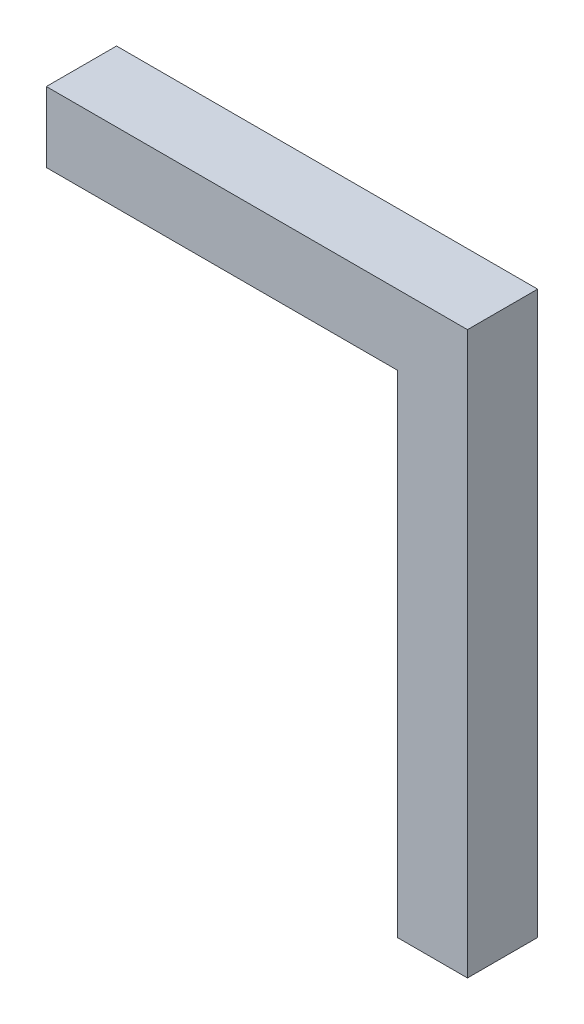
ISO-10303-21;
HEADER;
FILE_DESCRIPTION(('STEP AP214'),'2;1');
FILE_NAME('part.step','',(''),(''),'','','');
FILE_SCHEMA(('AUTOMOTIVE_DESIGN { 1 0 10303 214 1 1 1 1 }'));
ENDSEC;
DATA;
#1=APPLICATION_CONTEXT('core data for automotive mechanical design processes');
#2=APPLICATION_PROTOCOL_DEFINITION('international standard','automotive_design',2000,#1);
#3=PRODUCT_CONTEXT('',#1,'mechanical');
#4=PRODUCT('Part','Part','',(#3));
#5=PRODUCT_RELATED_PRODUCT_CATEGORY('part','',(#4));
#6=PRODUCT_DEFINITION_FORMATION('','',#4);
#7=PRODUCT_DEFINITION_CONTEXT('part definition',#1,'design');
#8=PRODUCT_DEFINITION('design','',#6,#7);
#9=PRODUCT_DEFINITION_SHAPE('','',#8);
#10=(LENGTH_UNIT() NAMED_UNIT(*) SI_UNIT(.MILLI.,.METRE.));
#11=(NAMED_UNIT(*) PLANE_ANGLE_UNIT() SI_UNIT($,.RADIAN.));
#12=(NAMED_UNIT(*) SI_UNIT($,.STERADIAN.) SOLID_ANGLE_UNIT());
#13=UNCERTAINTY_MEASURE_WITH_UNIT(LENGTH_MEASURE(1.E-05),#10,'distance_accuracy_value','');
#14=(GEOMETRIC_REPRESENTATION_CONTEXT(3) GLOBAL_UNCERTAINTY_ASSIGNED_CONTEXT((#13)) GLOBAL_UNIT_ASSIGNED_CONTEXT((#10,
#11,#12)) REPRESENTATION_CONTEXT('',''));
#15=CARTESIAN_POINT('',(0.,0.,0.));
#16=DIRECTION('',(0.,0.,1.));
#17=DIRECTION('',(1.,0.,0.));
#18=AXIS2_PLACEMENT_3D('',#15,#16,#17);
#19=CARTESIAN_POINT('',(-5.69999999999999,0.,0.5));
#20=DIRECTION('',(-1.,0.,0.));
#21=DIRECTION('',(0.,0.,1.));
#22=AXIS2_PLACEMENT_3D('',#19,#20,#21);
#23=PLANE('',#22);
#24=DIRECTION('',(0.,1.,0.));
#25=VECTOR('',#24,1.);
#26=CARTESIAN_POINT('',(-5.69999999999999,0.,0.));
#27=LINE('',#26,#25);
#28=CARTESIAN_POINT('',(-5.69999999999999,13.5626465300252,0.));
#29=VERTEX_POINT('',#28);
#30=CARTESIAN_POINT('',(-5.69999999999999,17.0626465300252,0.));
#31=VERTEX_POINT('',#30);
#32=EDGE_CURVE('E129',#29,#31,#27,.T.);
#33=ORIENTED_EDGE('',*,*,#32,.F.);
#34=DIRECTION('',(0.,0.,-1.));
#35=VECTOR('',#34,1.);
#36=CARTESIAN_POINT('',(-5.69999999999999,13.5626465300252,0.5));
#37=LINE('',#36,#35);
#38=CARTESIAN_POINT('',(-5.69999999999999,13.5626465300252,0.5));
#39=VERTEX_POINT('',#38);
#40=EDGE_CURVE('E11',#39,#29,#37,.T.);
#41=ORIENTED_EDGE('',*,*,#40,.F.);
#42=DIRECTION('',(0.,1.,0.));
#43=VECTOR('',#42,1.);
#44=CARTESIAN_POINT('',(-5.69999999999999,0.,0.5));
#45=LINE('',#44,#43);
#46=CARTESIAN_POINT('',(-5.69999999999999,17.0626465300252,0.5));
#47=VERTEX_POINT('',#46);
#48=EDGE_CURVE('E148',#39,#47,#45,.T.);
#49=ORIENTED_EDGE('',*,*,#48,.T.);
#50=DIRECTION('',(0.,0.,-1.));
#51=VECTOR('',#50,1.);
#52=CARTESIAN_POINT('',(-5.69999999999999,17.0626465300252,0.5));
#53=LINE('',#52,#51);
#54=EDGE_CURVE('E86',#47,#31,#53,.T.);
#55=ORIENTED_EDGE('',*,*,#54,.T.);
#56=EDGE_LOOP('',(#33,#41,#49,#55));
#57=FACE_BOUND('',#56,.T.);
#58=ADVANCED_FACE('F41',(#57),#23,.T.);
#59=CARTESIAN_POINT('',(0.,13.5626465300252,0.5));
#60=DIRECTION('',(0.,1.,0.));
#61=DIRECTION('',(0.,0.,1.));
#62=AXIS2_PLACEMENT_3D('',#59,#60,#61);
#63=PLANE('',#62);
#64=DIRECTION('',(1.,0.,0.));
#65=VECTOR('',#64,1.);
#66=CARTESIAN_POINT('',(0.,13.5626465300252,0.));
#67=LINE('',#66,#65);
#68=CARTESIAN_POINT('',(-5.19999999999999,13.5626465300252,0.));
#69=VERTEX_POINT('',#68);
#70=EDGE_CURVE('E133',#29,#69,#67,.T.);
#71=ORIENTED_EDGE('',*,*,#70,.T.);
#72=DIRECTION('',(0.,0.,-1.));
#73=VECTOR('',#72,1.);
#74=CARTESIAN_POINT('',(-5.19999999999999,13.5626465300252,0.5));
#75=LINE('',#74,#73);
#76=CARTESIAN_POINT('',(-5.19999999999999,13.5626465300252,0.5));
#77=VERTEX_POINT('',#76);
#78=EDGE_CURVE('E50',#77,#69,#75,.T.);
#79=ORIENTED_EDGE('',*,*,#78,.F.);
#80=DIRECTION('',(1.,0.,0.));
#81=VECTOR('',#80,1.);
#82=CARTESIAN_POINT('',(0.,13.5626465300252,0.5));
#83=LINE('',#82,#81);
#84=EDGE_CURVE('E123',#39,#77,#83,.T.);
#85=ORIENTED_EDGE('',*,*,#84,.F.);
#86=ORIENTED_EDGE('',*,*,#40,.T.);
#87=EDGE_LOOP('',(#71,#79,#85,#86));
#88=FACE_BOUND('',#87,.T.);
#89=ADVANCED_FACE('F161',(#88),#63,.F.);
#90=CARTESIAN_POINT('',(-5.19999999999999,0.,0.5));
#91=DIRECTION('',(1.,0.,0.));
#92=DIRECTION('',(0.,1.,0.));
#93=AXIS2_PLACEMENT_3D('',#90,#91,#92);
#94=PLANE('',#93);
#95=DIRECTION('',(0.,-1.,0.));
#96=VECTOR('',#95,1.);
#97=CARTESIAN_POINT('',(-5.19999999999999,0.,0.));
#98=LINE('',#97,#96);
#99=CARTESIAN_POINT('',(-5.19999999999999,17.5626465300252,0.));
#100=VERTEX_POINT('',#99);
#101=EDGE_CURVE('E137',#100,#69,#98,.T.);
#102=ORIENTED_EDGE('',*,*,#101,.F.);
#103=DIRECTION('',(0.,0.,-1.));
#104=VECTOR('',#103,1.);
#105=CARTESIAN_POINT('',(-5.19999999999999,17.5626465300252,0.5));
#106=LINE('',#105,#104);
#107=CARTESIAN_POINT('',(-5.19999999999999,17.5626465300252,0.5));
#108=VERTEX_POINT('',#107);
#109=EDGE_CURVE('E109',#108,#100,#106,.T.);
#110=ORIENTED_EDGE('',*,*,#109,.F.);
#111=DIRECTION('',(0.,-1.,0.));
#112=VECTOR('',#111,1.);
#113=CARTESIAN_POINT('',(-5.19999999999999,0.,0.5));
#114=LINE('',#113,#112);
#115=EDGE_CURVE('E119',#108,#77,#114,.T.);
#116=ORIENTED_EDGE('',*,*,#115,.T.);
#117=ORIENTED_EDGE('',*,*,#78,.T.);
#118=EDGE_LOOP('',(#102,#110,#116,#117));
#119=FACE_BOUND('',#118,.T.);
#120=ADVANCED_FACE('F158',(#119),#94,.T.);
#121=CARTESIAN_POINT('',(0.,17.5626465300252,0.5));
#122=DIRECTION('',(0.,1.,0.));
#123=DIRECTION('',(0.,0.,1.));
#124=AXIS2_PLACEMENT_3D('',#121,#122,#123);
#125=PLANE('',#124);
#126=DIRECTION('',(1.,0.,0.));
#127=VECTOR('',#126,1.);
#128=CARTESIAN_POINT('',(0.,17.5626465300252,0.));
#129=LINE('',#128,#127);
#130=CARTESIAN_POINT('',(-8.19999999999999,17.5626465300252,0.));
#131=VERTEX_POINT('',#130);
#132=EDGE_CURVE('E107',#131,#100,#129,.T.);
#133=ORIENTED_EDGE('',*,*,#132,.F.);
#134=DIRECTION('',(0.,0.,-1.));
#135=VECTOR('',#134,1.);
#136=CARTESIAN_POINT('',(-8.19999999999999,17.5626465300252,0.5));
#137=LINE('',#136,#135);
#138=CARTESIAN_POINT('',(-8.19999999999999,17.5626465300252,0.5));
#139=VERTEX_POINT('',#138);
#140=EDGE_CURVE('E101',#139,#131,#137,.T.);
#141=ORIENTED_EDGE('',*,*,#140,.F.);
#142=DIRECTION('',(1.,0.,0.));
#143=VECTOR('',#142,1.);
#144=CARTESIAN_POINT('',(0.,17.5626465300252,0.5));
#145=LINE('',#144,#143);
#146=EDGE_CURVE('E105',#139,#108,#145,.T.);
#147=ORIENTED_EDGE('',*,*,#146,.T.);
#148=ORIENTED_EDGE('',*,*,#109,.T.);
#149=EDGE_LOOP('',(#133,#141,#147,#148));
#150=FACE_BOUND('',#149,.T.);
#151=ADVANCED_FACE('F103',(#150),#125,.T.);
#152=CARTESIAN_POINT('',(-8.19999999999999,0.,0.5));
#153=DIRECTION('',(1.,0.,0.));
#154=DIRECTION('',(0.,0.,-1.));
#155=AXIS2_PLACEMENT_3D('',#152,#153,#154);
#156=PLANE('',#155);
#157=DIRECTION('',(0.,-1.,0.));
#158=VECTOR('',#157,1.);
#159=CARTESIAN_POINT('',(-8.19999999999999,0.,0.));
#160=LINE('',#159,#158);
#161=CARTESIAN_POINT('',(-8.19999999999999,17.0626465300252,0.));
#162=VERTEX_POINT('',#161);
#163=EDGE_CURVE('E79',#131,#162,#160,.T.);
#164=ORIENTED_EDGE('',*,*,#163,.T.);
#165=DIRECTION('',(0.,0.,-1.));
#166=VECTOR('',#165,1.);
#167=CARTESIAN_POINT('',(-8.19999999999999,17.0626465300252,0.5));
#168=LINE('',#167,#166);
#169=CARTESIAN_POINT('',(-8.19999999999999,17.0626465300252,0.5));
#170=VERTEX_POINT('',#169);
#171=EDGE_CURVE('E110',#170,#162,#168,.T.);
#172=ORIENTED_EDGE('',*,*,#171,.F.);
#173=DIRECTION('',(0.,-1.,0.));
#174=VECTOR('',#173,1.);
#175=CARTESIAN_POINT('',(-8.19999999999999,0.,0.5));
#176=LINE('',#175,#174);
#177=EDGE_CURVE('E112',#139,#170,#176,.T.);
#178=ORIENTED_EDGE('',*,*,#177,.F.);
#179=ORIENTED_EDGE('',*,*,#140,.T.);
#180=EDGE_LOOP('',(#164,#172,#178,#179));
#181=FACE_BOUND('',#180,.T.);
#182=ADVANCED_FACE('F113',(#181),#156,.F.);
#183=CARTESIAN_POINT('',(0.,17.0626465300252,0.5));
#184=DIRECTION('',(0.,1.,0.));
#185=DIRECTION('',(0.,0.,1.));
#186=AXIS2_PLACEMENT_3D('',#183,#184,#185);
#187=PLANE('',#186);
#188=DIRECTION('',(1.,0.,0.));
#189=VECTOR('',#188,1.);
#190=CARTESIAN_POINT('',(0.,17.0626465300252,0.));
#191=LINE('',#190,#189);
#192=EDGE_CURVE('E145',#162,#31,#191,.T.);
#193=ORIENTED_EDGE('',*,*,#192,.T.);
#194=ORIENTED_EDGE('',*,*,#54,.F.);
#195=DIRECTION('',(1.,0.,0.));
#196=VECTOR('',#195,1.);
#197=CARTESIAN_POINT('',(0.,17.0626465300252,0.5));
#198=LINE('',#197,#196);
#199=EDGE_CURVE('E58',#170,#47,#198,.T.);
#200=ORIENTED_EDGE('',*,*,#199,.F.);
#201=ORIENTED_EDGE('',*,*,#171,.T.);
#202=EDGE_LOOP('',(#193,#194,#200,#201));
#203=FACE_BOUND('',#202,.T.);
#204=ADVANCED_FACE('F166',(#203),#187,.F.);
#205=CARTESIAN_POINT('',(0.,0.,0.5));
#206=DIRECTION('',(0.,0.,1.));
#207=DIRECTION('',(1.,0.,0.));
#208=AXIS2_PLACEMENT_3D('',#205,#206,#207);
#209=PLANE('',#208);
#210=ORIENTED_EDGE('',*,*,#48,.F.);
#211=ORIENTED_EDGE('',*,*,#84,.T.);
#212=ORIENTED_EDGE('',*,*,#115,.F.);
#213=ORIENTED_EDGE('',*,*,#146,.F.);
#214=ORIENTED_EDGE('',*,*,#177,.T.);
#215=ORIENTED_EDGE('',*,*,#199,.T.);
#216=EDGE_LOOP('',(#210,#211,#212,#213,#214,#215));
#217=FACE_BOUND('',#216,.T.);
#218=ADVANCED_FACE('F117',(#217),#209,.T.);
#219=CARTESIAN_POINT('',(0.,0.,0.));
#220=DIRECTION('',(0.,0.,1.));
#221=DIRECTION('',(1.,0.,0.));
#222=AXIS2_PLACEMENT_3D('',#219,#220,#221);
#223=PLANE('',#222);
#224=ORIENTED_EDGE('',*,*,#32,.T.);
#225=ORIENTED_EDGE('',*,*,#192,.F.);
#226=ORIENTED_EDGE('',*,*,#163,.F.);
#227=ORIENTED_EDGE('',*,*,#132,.T.);
#228=ORIENTED_EDGE('',*,*,#101,.T.);
#229=ORIENTED_EDGE('',*,*,#70,.F.);
#230=EDGE_LOOP('',(#224,#225,#226,#227,#228,#229));
#231=FACE_BOUND('',#230,.T.);
#232=ADVANCED_FACE('F163',(#231),#223,.F.);
#233=CLOSED_SHELL('',(#58,#89,#120,#151,#182,#204,#218,#232));
#234=MANIFOLD_SOLID_BREP('B2',#233);
#235=ADVANCED_BREP_SHAPE_REPRESENTATION('',(#18,#234),#14);
#236=SHAPE_DEFINITION_REPRESENTATION(#9,#235);
ENDSEC;
END-ISO-10303-21;
